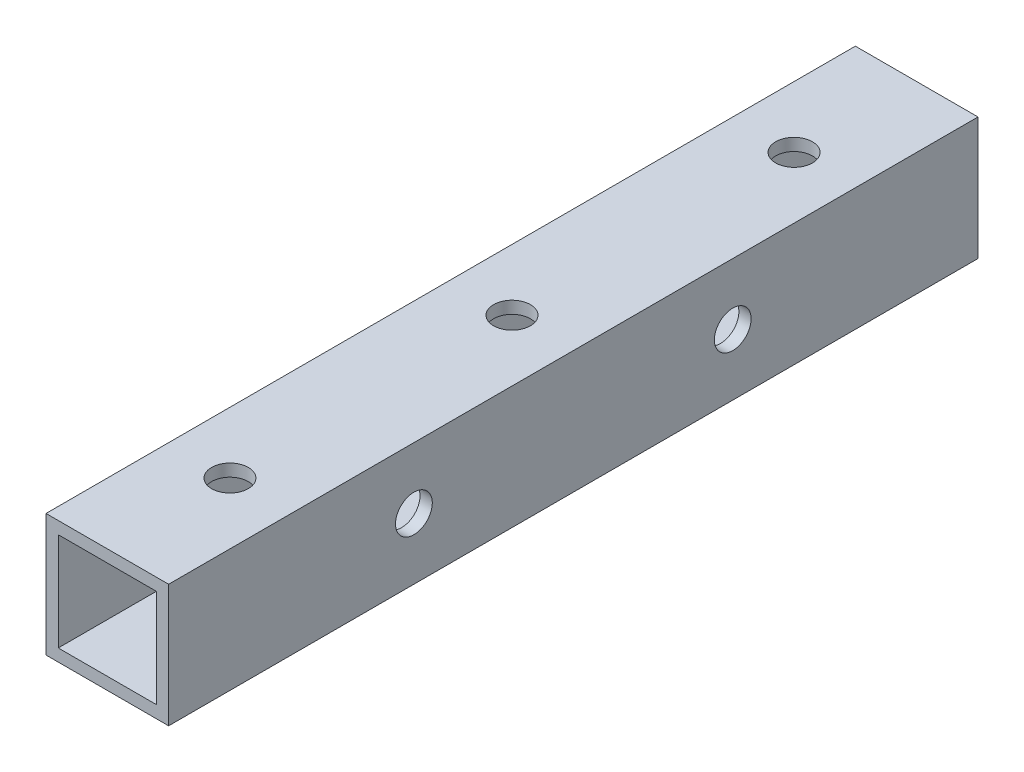
ISO-10303-21;
HEADER;
FILE_DESCRIPTION(('STEP AP214'),'2;1');
FILE_NAME('part.step','',(''),(''),'','','');
FILE_SCHEMA(('AUTOMOTIVE_DESIGN { 1 0 10303 214 1 1 1 1 }'));
ENDSEC;
DATA;
#1=APPLICATION_CONTEXT('core data for automotive mechanical design processes');
#2=APPLICATION_PROTOCOL_DEFINITION('international standard','automotive_design',2000,#1);
#3=PRODUCT_CONTEXT('',#1,'mechanical');
#4=PRODUCT('Part','Part','',(#3));
#5=PRODUCT_RELATED_PRODUCT_CATEGORY('part','',(#4));
#6=PRODUCT_DEFINITION_FORMATION('','',#4);
#7=PRODUCT_DEFINITION_CONTEXT('part definition',#1,'design');
#8=PRODUCT_DEFINITION('design','',#6,#7);
#9=PRODUCT_DEFINITION_SHAPE('','',#8);
#10=(LENGTH_UNIT() NAMED_UNIT(*) SI_UNIT(.MILLI.,.METRE.));
#11=(NAMED_UNIT(*) PLANE_ANGLE_UNIT() SI_UNIT($,.RADIAN.));
#12=(NAMED_UNIT(*) SI_UNIT($,.STERADIAN.) SOLID_ANGLE_UNIT());
#13=UNCERTAINTY_MEASURE_WITH_UNIT(LENGTH_MEASURE(1.E-05),#10,'distance_accuracy_value','');
#14=(GEOMETRIC_REPRESENTATION_CONTEXT(3) GLOBAL_UNCERTAINTY_ASSIGNED_CONTEXT((#13)) GLOBAL_UNIT_ASSIGNED_CONTEXT((#10,
#11,#12)) REPRESENTATION_CONTEXT('',''));
#15=CARTESIAN_POINT('',(0.,0.,0.));
#16=DIRECTION('',(0.,0.,1.));
#17=DIRECTION('',(1.,0.,0.));
#18=AXIS2_PLACEMENT_3D('',#15,#16,#17);
#19=CARTESIAN_POINT('',(0.,0.,66.));
#20=DIRECTION('',(0.,0.,1.));
#21=DIRECTION('',(1.,0.,0.));
#22=AXIS2_PLACEMENT_3D('',#19,#20,#21);
#23=PLANE('',#22);
#24=DIRECTION('',(0.,1.,0.));
#25=VECTOR('',#24,1.);
#26=CARTESIAN_POINT('',(-58.1295848709085,118.346996024389,66.));
#27=LINE('',#26,#25);
#28=CARTESIAN_POINT('',(-58.1295848709085,108.346996024389,66.));
#29=VERTEX_POINT('',#28);
#30=CARTESIAN_POINT('',(-58.1295848709085,118.346996024389,66.));
#31=VERTEX_POINT('',#30);
#32=EDGE_CURVE('E168',#29,#31,#27,.T.);
#33=ORIENTED_EDGE('',*,*,#32,.T.);
#34=DIRECTION('',(-1.,0.,0.));
#35=VECTOR('',#34,1.);
#36=CARTESIAN_POINT('',(-58.1295848709085,118.346996024389,66.));
#37=LINE('',#36,#35);
#38=CARTESIAN_POINT('',(-68.1295848709085,118.346996024389,66.));
#39=VERTEX_POINT('',#38);
#40=EDGE_CURVE('E171',#31,#39,#37,.T.);
#41=ORIENTED_EDGE('',*,*,#40,.T.);
#42=DIRECTION('',(0.,-1.,0.));
#43=VECTOR('',#42,1.);
#44=CARTESIAN_POINT('',(-68.1295848709085,118.346996024389,66.));
#45=LINE('',#44,#43);
#46=CARTESIAN_POINT('',(-68.1295848709085,108.346996024389,66.));
#47=VERTEX_POINT('',#46);
#48=EDGE_CURVE('E174',#39,#47,#45,.T.);
#49=ORIENTED_EDGE('',*,*,#48,.T.);
#50=DIRECTION('',(1.,0.,0.));
#51=VECTOR('',#50,1.);
#52=CARTESIAN_POINT('',(-58.1295848709085,108.346996024389,66.));
#53=LINE('',#52,#51);
#54=EDGE_CURVE('E176',#47,#29,#53,.T.);
#55=ORIENTED_EDGE('',*,*,#54,.T.);
#56=EDGE_LOOP('',(#33,#41,#49,#55));
#57=FACE_BOUND('',#56,.T.);
#58=DIRECTION('',(-1.,0.,0.));
#59=VECTOR('',#58,1.);
#60=CARTESIAN_POINT('',(0.,117.346996024389,66.));
#61=LINE('',#60,#59);
#62=CARTESIAN_POINT('',(-59.1295848709085,117.346996024389,66.));
#63=VERTEX_POINT('',#62);
#64=CARTESIAN_POINT('',(-67.1295848709085,117.346996024389,66.));
#65=VERTEX_POINT('',#64);
#66=EDGE_CURVE('E138',#63,#65,#61,.T.);
#67=ORIENTED_EDGE('',*,*,#66,.F.);
#68=DIRECTION('',(0.,1.,0.));
#69=VECTOR('',#68,1.);
#70=CARTESIAN_POINT('',(-59.1295848709085,0.,66.));
#71=LINE('',#70,#69);
#72=CARTESIAN_POINT('',(-59.1295848709085,109.346996024389,66.));
#73=VERTEX_POINT('',#72);
#74=EDGE_CURVE('E130',#73,#63,#71,.T.);
#75=ORIENTED_EDGE('',*,*,#74,.F.);
#76=DIRECTION('',(1.,0.,0.));
#77=VECTOR('',#76,1.);
#78=CARTESIAN_POINT('',(0.,109.346996024389,66.));
#79=LINE('',#78,#77);
#80=CARTESIAN_POINT('',(-67.1295848709085,109.346996024389,66.));
#81=VERTEX_POINT('',#80);
#82=EDGE_CURVE('E152',#81,#73,#79,.T.);
#83=ORIENTED_EDGE('',*,*,#82,.F.);
#84=DIRECTION('',(0.,-1.,0.));
#85=VECTOR('',#84,1.);
#86=CARTESIAN_POINT('',(-67.1295848709085,0.,66.));
#87=LINE('',#86,#85);
#88=EDGE_CURVE('E150',#65,#81,#87,.T.);
#89=ORIENTED_EDGE('',*,*,#88,.F.);
#90=EDGE_LOOP('',(#67,#75,#83,#89));
#91=FACE_BOUND('',#90,.T.);
#92=ADVANCED_FACE('F63',(#57,#91),#23,.T.);
#93=CARTESIAN_POINT('',(0.,0.,0.));
#94=DIRECTION('',(0.,0.,1.));
#95=DIRECTION('',(1.,0.,0.));
#96=AXIS2_PLACEMENT_3D('',#93,#94,#95);
#97=PLANE('',#96);
#98=DIRECTION('',(0.,1.,0.));
#99=VECTOR('',#98,1.);
#100=CARTESIAN_POINT('',(-58.1295848709085,118.346996024389,0.));
#101=LINE('',#100,#99);
#102=CARTESIAN_POINT('',(-58.1295848709085,108.346996024389,0.));
#103=VERTEX_POINT('',#102);
#104=CARTESIAN_POINT('',(-58.1295848709085,118.346996024389,0.));
#105=VERTEX_POINT('',#104);
#106=EDGE_CURVE('E146',#103,#105,#101,.T.);
#107=ORIENTED_EDGE('',*,*,#106,.F.);
#108=DIRECTION('',(1.,0.,0.));
#109=VECTOR('',#108,1.);
#110=CARTESIAN_POINT('',(-58.1295848709085,108.346996024389,0.));
#111=LINE('',#110,#109);
#112=CARTESIAN_POINT('',(-68.1295848709085,108.346996024389,0.));
#113=VERTEX_POINT('',#112);
#114=EDGE_CURVE('E172',#113,#103,#111,.T.);
#115=ORIENTED_EDGE('',*,*,#114,.F.);
#116=DIRECTION('',(0.,-1.,0.));
#117=VECTOR('',#116,1.);
#118=CARTESIAN_POINT('',(-68.1295848709085,118.346996024389,0.));
#119=LINE('',#118,#117);
#120=CARTESIAN_POINT('',(-68.1295848709085,118.346996024389,0.));
#121=VERTEX_POINT('',#120);
#122=EDGE_CURVE('E183',#121,#113,#119,.T.);
#123=ORIENTED_EDGE('',*,*,#122,.F.);
#124=DIRECTION('',(-1.,0.,0.));
#125=VECTOR('',#124,1.);
#126=CARTESIAN_POINT('',(-58.1295848709085,118.346996024389,0.));
#127=LINE('',#126,#125);
#128=EDGE_CURVE('E181',#105,#121,#127,.T.);
#129=ORIENTED_EDGE('',*,*,#128,.F.);
#130=EDGE_LOOP('',(#107,#115,#123,#129));
#131=FACE_BOUND('',#130,.T.);
#132=DIRECTION('',(0.,1.,0.));
#133=VECTOR('',#132,1.);
#134=CARTESIAN_POINT('',(-59.1295848709085,0.,0.));
#135=LINE('',#134,#133);
#136=CARTESIAN_POINT('',(-59.1295848709085,109.346996024389,0.));
#137=VERTEX_POINT('',#136);
#138=CARTESIAN_POINT('',(-59.1295848709085,117.346996024389,0.));
#139=VERTEX_POINT('',#138);
#140=EDGE_CURVE('E88',#137,#139,#135,.T.);
#141=ORIENTED_EDGE('',*,*,#140,.T.);
#142=DIRECTION('',(-1.,0.,0.));
#143=VECTOR('',#142,1.);
#144=CARTESIAN_POINT('',(0.,117.346996024389,0.));
#145=LINE('',#144,#143);
#146=CARTESIAN_POINT('',(-67.1295848709085,117.346996024389,0.));
#147=VERTEX_POINT('',#146);
#148=EDGE_CURVE('E145',#139,#147,#145,.T.);
#149=ORIENTED_EDGE('',*,*,#148,.T.);
#150=DIRECTION('',(0.,-1.,0.));
#151=VECTOR('',#150,1.);
#152=CARTESIAN_POINT('',(-67.1295848709085,0.,0.));
#153=LINE('',#152,#151);
#154=CARTESIAN_POINT('',(-67.1295848709085,109.346996024389,0.));
#155=VERTEX_POINT('',#154);
#156=EDGE_CURVE('E160',#147,#155,#153,.T.);
#157=ORIENTED_EDGE('',*,*,#156,.T.);
#158=DIRECTION('',(1.,0.,0.));
#159=VECTOR('',#158,1.);
#160=CARTESIAN_POINT('',(0.,109.346996024389,0.));
#161=LINE('',#160,#159);
#162=EDGE_CURVE('E139',#155,#137,#161,.T.);
#163=ORIENTED_EDGE('',*,*,#162,.T.);
#164=EDGE_LOOP('',(#141,#149,#157,#163));
#165=FACE_BOUND('',#164,.T.);
#166=ADVANCED_FACE('F258',(#131,#165),#97,.F.);
#167=CARTESIAN_POINT('',(-58.1295848709085,118.346996024389,66.));
#168=DIRECTION('',(-1.,0.,0.));
#169=DIRECTION('',(0.,0.,1.));
#170=AXIS2_PLACEMENT_3D('',#167,#168,#169);
#171=PLANE('',#170);
#172=CARTESIAN_POINT('',(-58.1295848709085,113.346996024389,20.));
#173=DIRECTION('',(1.,0.,0.));
#174=DIRECTION('',(0.,0.,-1.));
#175=AXIS2_PLACEMENT_3D('',#172,#173,#174);
#176=CIRCLE('',#175,1.5);
#177=CARTESIAN_POINT('',(-58.1295848709085,113.346996024389,18.5));
#178=VERTEX_POINT('',#177);
#179=EDGE_CURVE('E226',#178,#178,#176,.T.);
#180=ORIENTED_EDGE('',*,*,#179,.F.);
#181=EDGE_LOOP('',(#180));
#182=FACE_BOUND('',#181,.T.);
#183=CARTESIAN_POINT('',(-58.1295848709085,113.346996024389,46.));
#184=DIRECTION('',(1.,0.,0.));
#185=DIRECTION('',(0.,0.,1.));
#186=AXIS2_PLACEMENT_3D('',#183,#184,#185);
#187=CIRCLE('',#186,1.5);
#188=CARTESIAN_POINT('',(-58.1295848709085,113.346996024389,47.5));
#189=VERTEX_POINT('',#188);
#190=EDGE_CURVE('E229',#189,#189,#187,.T.);
#191=ORIENTED_EDGE('',*,*,#190,.F.);
#192=EDGE_LOOP('',(#191));
#193=FACE_BOUND('',#192,.T.);
#194=ORIENTED_EDGE('',*,*,#106,.T.);
#195=DIRECTION('',(0.,0.,-1.));
#196=VECTOR('',#195,1.);
#197=CARTESIAN_POINT('',(-58.1295848709085,118.346996024389,66.));
#198=LINE('',#197,#196);
#199=EDGE_CURVE('E12',#31,#105,#198,.T.);
#200=ORIENTED_EDGE('',*,*,#199,.F.);
#201=ORIENTED_EDGE('',*,*,#32,.F.);
#202=DIRECTION('',(0.,0.,-1.));
#203=VECTOR('',#202,1.);
#204=CARTESIAN_POINT('',(-58.1295848709085,108.346996024389,66.));
#205=LINE('',#204,#203);
#206=EDGE_CURVE('E178',#29,#103,#205,.T.);
#207=ORIENTED_EDGE('',*,*,#206,.T.);
#208=EDGE_LOOP('',(#194,#200,#201,#207));
#209=FACE_BOUND('',#208,.T.);
#210=ADVANCED_FACE('F65',(#182,#193,#209),#171,.F.);
#211=CARTESIAN_POINT('',(-58.1295848709085,118.346996024389,66.));
#212=DIRECTION('',(0.,-1.,0.));
#213=DIRECTION('',(0.,0.,-1.));
#214=AXIS2_PLACEMENT_3D('',#211,#212,#213);
#215=PLANE('',#214);
#216=CARTESIAN_POINT('',(-63.1295848709085,118.346996024389,10.));
#217=DIRECTION('',(0.,-1.,0.));
#218=DIRECTION('',(0.,0.,-1.));
#219=AXIS2_PLACEMENT_3D('',#216,#217,#218);
#220=CIRCLE('',#219,1.5);
#221=CARTESIAN_POINT('',(-63.1295848709085,118.346996024389,8.5));
#222=VERTEX_POINT('',#221);
#223=EDGE_CURVE('E204',#222,#222,#220,.T.);
#224=ORIENTED_EDGE('',*,*,#223,.T.);
#225=EDGE_LOOP('',(#224));
#226=FACE_BOUND('',#225,.T.);
#227=CARTESIAN_POINT('',(-63.1295848709085,118.346996024389,56.));
#228=DIRECTION('',(0.,-1.,0.));
#229=DIRECTION('',(0.,0.,1.));
#230=AXIS2_PLACEMENT_3D('',#227,#228,#229);
#231=CIRCLE('',#230,1.5);
#232=CARTESIAN_POINT('',(-63.1295848709085,118.346996024389,57.5));
#233=VERTEX_POINT('',#232);
#234=EDGE_CURVE('E347',#233,#233,#231,.T.);
#235=ORIENTED_EDGE('',*,*,#234,.T.);
#236=EDGE_LOOP('',(#235));
#237=FACE_BOUND('',#236,.T.);
#238=CARTESIAN_POINT('',(-63.1295848709085,118.346996024389,33.));
#239=DIRECTION('',(0.,-1.,0.));
#240=DIRECTION('',(0.,0.,-1.));
#241=AXIS2_PLACEMENT_3D('',#238,#239,#240);
#242=CIRCLE('',#241,1.5);
#243=CARTESIAN_POINT('',(-63.1295848709085,118.346996024389,31.5));
#244=VERTEX_POINT('',#243);
#245=EDGE_CURVE('E217',#244,#244,#242,.T.);
#246=ORIENTED_EDGE('',*,*,#245,.T.);
#247=EDGE_LOOP('',(#246));
#248=FACE_BOUND('',#247,.T.);
#249=ORIENTED_EDGE('',*,*,#128,.T.);
#250=DIRECTION('',(0.,0.,-1.));
#251=VECTOR('',#250,1.);
#252=CARTESIAN_POINT('',(-68.1295848709085,118.346996024389,66.));
#253=LINE('',#252,#251);
#254=EDGE_CURVE('E72',#39,#121,#253,.T.);
#255=ORIENTED_EDGE('',*,*,#254,.F.);
#256=ORIENTED_EDGE('',*,*,#40,.F.);
#257=ORIENTED_EDGE('',*,*,#199,.T.);
#258=EDGE_LOOP('',(#249,#255,#256,#257));
#259=FACE_BOUND('',#258,.T.);
#260=ADVANCED_FACE('F257',(#226,#237,#248,#259),#215,.F.);
#261=CARTESIAN_POINT('',(-68.1295848709085,118.346996024389,66.));
#262=DIRECTION('',(1.,0.,0.));
#263=DIRECTION('',(0.,0.,-1.));
#264=AXIS2_PLACEMENT_3D('',#261,#262,#263);
#265=PLANE('',#264);
#266=CARTESIAN_POINT('',(-68.1295848709085,113.346996024389,20.));
#267=DIRECTION('',(1.,0.,0.));
#268=DIRECTION('',(0.,0.,-1.));
#269=AXIS2_PLACEMENT_3D('',#266,#267,#268);
#270=CIRCLE('',#269,1.5);
#271=CARTESIAN_POINT('',(-68.1295848709085,113.346996024389,18.5));
#272=VERTEX_POINT('',#271);
#273=EDGE_CURVE('E197',#272,#272,#270,.T.);
#274=ORIENTED_EDGE('',*,*,#273,.T.);
#275=EDGE_LOOP('',(#274));
#276=FACE_BOUND('',#275,.T.);
#277=CARTESIAN_POINT('',(-68.1295848709085,113.346996024389,46.));
#278=DIRECTION('',(1.,0.,0.));
#279=DIRECTION('',(0.,0.,1.));
#280=AXIS2_PLACEMENT_3D('',#277,#278,#279);
#281=CIRCLE('',#280,1.5);
#282=CARTESIAN_POINT('',(-68.1295848709085,113.346996024389,47.5));
#283=VERTEX_POINT('',#282);
#284=EDGE_CURVE('E223',#283,#283,#281,.T.);
#285=ORIENTED_EDGE('',*,*,#284,.T.);
#286=EDGE_LOOP('',(#285));
#287=FACE_BOUND('',#286,.T.);
#288=ORIENTED_EDGE('',*,*,#122,.T.);
#289=DIRECTION('',(0.,0.,-1.));
#290=VECTOR('',#289,1.);
#291=CARTESIAN_POINT('',(-68.1295848709085,108.346996024389,66.));
#292=LINE('',#291,#290);
#293=EDGE_CURVE('E188',#47,#113,#292,.T.);
#294=ORIENTED_EDGE('',*,*,#293,.F.);
#295=ORIENTED_EDGE('',*,*,#48,.F.);
#296=ORIENTED_EDGE('',*,*,#254,.T.);
#297=EDGE_LOOP('',(#288,#294,#295,#296));
#298=FACE_BOUND('',#297,.T.);
#299=ADVANCED_FACE('F276',(#276,#287,#298),#265,.F.);
#300=CARTESIAN_POINT('',(-58.1295848709085,108.346996024389,66.));
#301=DIRECTION('',(0.,1.,0.));
#302=DIRECTION('',(0.,0.,1.));
#303=AXIS2_PLACEMENT_3D('',#300,#301,#302);
#304=PLANE('',#303);
#305=CARTESIAN_POINT('',(-63.1295848709085,108.346996024389,10.));
#306=DIRECTION('',(0.,-1.,0.));
#307=DIRECTION('',(0.,0.,-1.));
#308=AXIS2_PLACEMENT_3D('',#305,#306,#307);
#309=CIRCLE('',#308,1.5);
#310=CARTESIAN_POINT('',(-63.1295848709085,108.346996024389,8.5));
#311=VERTEX_POINT('',#310);
#312=EDGE_CURVE('E339',#311,#311,#309,.T.);
#313=ORIENTED_EDGE('',*,*,#312,.F.);
#314=EDGE_LOOP('',(#313));
#315=FACE_BOUND('',#314,.T.);
#316=CARTESIAN_POINT('',(-63.1295848709085,108.346996024389,56.));
#317=DIRECTION('',(0.,-1.,0.));
#318=DIRECTION('',(0.,0.,1.));
#319=AXIS2_PLACEMENT_3D('',#316,#317,#318);
#320=CIRCLE('',#319,1.5);
#321=CARTESIAN_POINT('',(-63.1295848709085,108.346996024389,57.5));
#322=VERTEX_POINT('',#321);
#323=EDGE_CURVE('E342',#322,#322,#320,.T.);
#324=ORIENTED_EDGE('',*,*,#323,.F.);
#325=EDGE_LOOP('',(#324));
#326=FACE_BOUND('',#325,.T.);
#327=CARTESIAN_POINT('',(-63.1295848709085,108.346996024389,33.));
#328=DIRECTION('',(0.,-1.,0.));
#329=DIRECTION('',(0.,0.,-1.));
#330=AXIS2_PLACEMENT_3D('',#327,#328,#329);
#331=CIRCLE('',#330,1.5);
#332=CARTESIAN_POINT('',(-63.1295848709085,108.346996024389,31.5));
#333=VERTEX_POINT('',#332);
#334=EDGE_CURVE('E349',#333,#333,#331,.T.);
#335=ORIENTED_EDGE('',*,*,#334,.F.);
#336=EDGE_LOOP('',(#335));
#337=FACE_BOUND('',#336,.T.);
#338=ORIENTED_EDGE('',*,*,#114,.T.);
#339=ORIENTED_EDGE('',*,*,#206,.F.);
#340=ORIENTED_EDGE('',*,*,#54,.F.);
#341=ORIENTED_EDGE('',*,*,#293,.T.);
#342=EDGE_LOOP('',(#338,#339,#340,#341));
#343=FACE_BOUND('',#342,.T.);
#344=ADVANCED_FACE('F243',(#315,#326,#337,#343),#304,.F.);
#345=CARTESIAN_POINT('',(-59.1295848709085,0.,66.));
#346=DIRECTION('',(-1.,0.,0.));
#347=DIRECTION('',(0.,0.,1.));
#348=AXIS2_PLACEMENT_3D('',#345,#346,#347);
#349=PLANE('',#348);
#350=CARTESIAN_POINT('',(-59.1295848709085,113.346996024389,20.));
#351=DIRECTION('',(-1.,0.,0.));
#352=DIRECTION('',(0.,0.,1.));
#353=AXIS2_PLACEMENT_3D('',#350,#351,#352);
#354=CIRCLE('',#353,1.5);
#355=CARTESIAN_POINT('',(-59.1295848709085,113.346996024389,21.5));
#356=VERTEX_POINT('',#355);
#357=EDGE_CURVE('E158',#356,#356,#354,.T.);
#358=ORIENTED_EDGE('',*,*,#357,.F.);
#359=EDGE_LOOP('',(#358));
#360=FACE_BOUND('',#359,.T.);
#361=CARTESIAN_POINT('',(-59.1295848709085,113.346996024389,46.));
#362=DIRECTION('',(-1.,0.,0.));
#363=DIRECTION('',(0.,0.,1.));
#364=AXIS2_PLACEMENT_3D('',#361,#362,#363);
#365=CIRCLE('',#364,1.5);
#366=CARTESIAN_POINT('',(-59.1295848709085,113.346996024389,47.5));
#367=VERTEX_POINT('',#366);
#368=EDGE_CURVE('E196',#367,#367,#365,.T.);
#369=ORIENTED_EDGE('',*,*,#368,.F.);
#370=EDGE_LOOP('',(#369));
#371=FACE_BOUND('',#370,.T.);
#372=ORIENTED_EDGE('',*,*,#140,.F.);
#373=DIRECTION('',(0.,0.,-1.));
#374=VECTOR('',#373,1.);
#375=CARTESIAN_POINT('',(-59.1295848709085,109.346996024389,66.));
#376=LINE('',#375,#374);
#377=EDGE_CURVE('E134',#73,#137,#376,.T.);
#378=ORIENTED_EDGE('',*,*,#377,.F.);
#379=ORIENTED_EDGE('',*,*,#74,.T.);
#380=DIRECTION('',(0.,0.,-1.));
#381=VECTOR('',#380,1.);
#382=CARTESIAN_POINT('',(-59.1295848709085,117.346996024389,66.));
#383=LINE('',#382,#381);
#384=EDGE_CURVE('E133',#63,#139,#383,.T.);
#385=ORIENTED_EDGE('',*,*,#384,.T.);
#386=EDGE_LOOP('',(#372,#378,#379,#385));
#387=FACE_BOUND('',#386,.T.);
#388=ADVANCED_FACE('F132',(#360,#371,#387),#349,.T.);
#389=CARTESIAN_POINT('',(0.,117.346996024389,66.));
#390=DIRECTION('',(0.,-1.,0.));
#391=DIRECTION('',(0.,0.,-1.));
#392=AXIS2_PLACEMENT_3D('',#389,#390,#391);
#393=PLANE('',#392);
#394=CARTESIAN_POINT('',(-63.1295848709085,117.346996024389,10.));
#395=DIRECTION('',(0.,-1.,0.));
#396=DIRECTION('',(0.,0.,-1.));
#397=AXIS2_PLACEMENT_3D('',#394,#395,#396);
#398=CIRCLE('',#397,1.5);
#399=CARTESIAN_POINT('',(-63.1295848709085,117.346996024389,8.5));
#400=VERTEX_POINT('',#399);
#401=EDGE_CURVE('E220',#400,#400,#398,.T.);
#402=ORIENTED_EDGE('',*,*,#401,.F.);
#403=EDGE_LOOP('',(#402));
#404=FACE_BOUND('',#403,.T.);
#405=CARTESIAN_POINT('',(-63.1295848709085,117.346996024389,56.));
#406=DIRECTION('',(0.,-1.,0.));
#407=DIRECTION('',(0.,0.,-1.));
#408=AXIS2_PLACEMENT_3D('',#405,#406,#407);
#409=CIRCLE('',#408,1.5);
#410=CARTESIAN_POINT('',(-63.1295848709085,117.346996024389,54.5));
#411=VERTEX_POINT('',#410);
#412=EDGE_CURVE('E207',#411,#411,#409,.T.);
#413=ORIENTED_EDGE('',*,*,#412,.F.);
#414=EDGE_LOOP('',(#413));
#415=FACE_BOUND('',#414,.T.);
#416=CARTESIAN_POINT('',(-63.1295848709085,117.346996024389,33.));
#417=DIRECTION('',(0.,-1.,0.));
#418=DIRECTION('',(0.,0.,-1.));
#419=AXIS2_PLACEMENT_3D('',#416,#417,#418);
#420=CIRCLE('',#419,1.5);
#421=CARTESIAN_POINT('',(-63.1295848709085,117.346996024389,31.5));
#422=VERTEX_POINT('',#421);
#423=EDGE_CURVE('E203',#422,#422,#420,.T.);
#424=ORIENTED_EDGE('',*,*,#423,.F.);
#425=EDGE_LOOP('',(#424));
#426=FACE_BOUND('',#425,.T.);
#427=ORIENTED_EDGE('',*,*,#148,.F.);
#428=ORIENTED_EDGE('',*,*,#384,.F.);
#429=ORIENTED_EDGE('',*,*,#66,.T.);
#430=DIRECTION('',(0.,0.,-1.));
#431=VECTOR('',#430,1.);
#432=CARTESIAN_POINT('',(-67.1295848709085,117.346996024389,66.));
#433=LINE('',#432,#431);
#434=EDGE_CURVE('E147',#65,#147,#433,.T.);
#435=ORIENTED_EDGE('',*,*,#434,.T.);
#436=EDGE_LOOP('',(#427,#428,#429,#435));
#437=FACE_BOUND('',#436,.T.);
#438=ADVANCED_FACE('F142',(#404,#415,#426,#437),#393,.T.);
#439=CARTESIAN_POINT('',(-67.1295848709085,0.,66.));
#440=DIRECTION('',(1.,0.,0.));
#441=DIRECTION('',(0.,0.,-1.));
#442=AXIS2_PLACEMENT_3D('',#439,#440,#441);
#443=PLANE('',#442);
#444=CARTESIAN_POINT('',(-67.1295848709085,113.346996024389,20.));
#445=DIRECTION('',(1.,0.,0.));
#446=DIRECTION('',(0.,0.,-1.));
#447=AXIS2_PLACEMENT_3D('',#444,#445,#446);
#448=CIRCLE('',#447,1.5);
#449=CARTESIAN_POINT('',(-67.1295848709085,113.346996024389,18.5));
#450=VERTEX_POINT('',#449);
#451=EDGE_CURVE('E198',#450,#450,#448,.T.);
#452=ORIENTED_EDGE('',*,*,#451,.F.);
#453=EDGE_LOOP('',(#452));
#454=FACE_BOUND('',#453,.T.);
#455=CARTESIAN_POINT('',(-67.1295848709085,113.346996024389,46.));
#456=DIRECTION('',(1.,0.,0.));
#457=DIRECTION('',(0.,0.,-1.));
#458=AXIS2_PLACEMENT_3D('',#455,#456,#457);
#459=CIRCLE('',#458,1.5);
#460=CARTESIAN_POINT('',(-67.1295848709085,113.346996024389,44.5));
#461=VERTEX_POINT('',#460);
#462=EDGE_CURVE('E193',#461,#461,#459,.T.);
#463=ORIENTED_EDGE('',*,*,#462,.F.);
#464=EDGE_LOOP('',(#463));
#465=FACE_BOUND('',#464,.T.);
#466=ORIENTED_EDGE('',*,*,#156,.F.);
#467=ORIENTED_EDGE('',*,*,#434,.F.);
#468=ORIENTED_EDGE('',*,*,#88,.T.);
#469=DIRECTION('',(0.,0.,-1.));
#470=VECTOR('',#469,1.);
#471=CARTESIAN_POINT('',(-67.1295848709085,109.346996024389,66.));
#472=LINE('',#471,#470);
#473=EDGE_CURVE('E80',#81,#155,#472,.T.);
#474=ORIENTED_EDGE('',*,*,#473,.T.);
#475=EDGE_LOOP('',(#466,#467,#468,#474));
#476=FACE_BOUND('',#475,.T.);
#477=ADVANCED_FACE('F297',(#454,#465,#476),#443,.T.);
#478=CARTESIAN_POINT('',(0.,109.346996024389,66.));
#479=DIRECTION('',(0.,1.,0.));
#480=DIRECTION('',(0.,0.,1.));
#481=AXIS2_PLACEMENT_3D('',#478,#479,#480);
#482=PLANE('',#481);
#483=CARTESIAN_POINT('',(-63.1295848709085,109.346996024389,10.));
#484=DIRECTION('',(0.,1.,0.));
#485=DIRECTION('',(0.,0.,1.));
#486=AXIS2_PLACEMENT_3D('',#483,#484,#485);
#487=CIRCLE('',#486,1.5);
#488=CARTESIAN_POINT('',(-63.1295848709085,109.346996024389,11.5));
#489=VERTEX_POINT('',#488);
#490=EDGE_CURVE('E67',#489,#489,#487,.T.);
#491=ORIENTED_EDGE('',*,*,#490,.F.);
#492=EDGE_LOOP('',(#491));
#493=FACE_BOUND('',#492,.T.);
#494=CARTESIAN_POINT('',(-63.1295848709085,109.346996024389,56.));
#495=DIRECTION('',(0.,1.,0.));
#496=DIRECTION('',(0.,0.,1.));
#497=AXIS2_PLACEMENT_3D('',#494,#495,#496);
#498=CIRCLE('',#497,1.5);
#499=CARTESIAN_POINT('',(-63.1295848709085,109.346996024389,57.5));
#500=VERTEX_POINT('',#499);
#501=EDGE_CURVE('E205',#500,#500,#498,.T.);
#502=ORIENTED_EDGE('',*,*,#501,.F.);
#503=EDGE_LOOP('',(#502));
#504=FACE_BOUND('',#503,.T.);
#505=CARTESIAN_POINT('',(-63.1295848709085,109.346996024389,33.));
#506=DIRECTION('',(0.,1.,0.));
#507=DIRECTION('',(0.,0.,1.));
#508=AXIS2_PLACEMENT_3D('',#505,#506,#507);
#509=CIRCLE('',#508,1.5);
#510=CARTESIAN_POINT('',(-63.1295848709085,109.346996024389,34.5));
#511=VERTEX_POINT('',#510);
#512=EDGE_CURVE('E201',#511,#511,#509,.T.);
#513=ORIENTED_EDGE('',*,*,#512,.F.);
#514=EDGE_LOOP('',(#513));
#515=FACE_BOUND('',#514,.T.);
#516=ORIENTED_EDGE('',*,*,#162,.F.);
#517=ORIENTED_EDGE('',*,*,#473,.F.);
#518=ORIENTED_EDGE('',*,*,#82,.T.);
#519=ORIENTED_EDGE('',*,*,#377,.T.);
#520=EDGE_LOOP('',(#516,#517,#518,#519));
#521=FACE_BOUND('',#520,.T.);
#522=ADVANCED_FACE('F301',(#493,#504,#515,#521),#482,.T.);
#523=CARTESIAN_POINT('',(-68.1295848709085,113.346996024389,46.));
#524=DIRECTION('',(1.,0.,0.));
#525=DIRECTION('',(0.,0.,-1.));
#526=AXIS2_PLACEMENT_3D('',#523,#524,#525);
#527=CYLINDRICAL_SURFACE('',#526,1.5);
#528=ORIENTED_EDGE('',*,*,#462,.T.);
#529=EDGE_LOOP('',(#528));
#530=FACE_BOUND('',#529,.T.);
#531=ORIENTED_EDGE('',*,*,#284,.F.);
#532=EDGE_LOOP('',(#531));
#533=FACE_BOUND('',#532,.T.);
#534=ADVANCED_FACE('F252',(#530,#533),#527,.F.);
#535=CARTESIAN_POINT('',(-68.1295848709085,113.346996024389,20.));
#536=DIRECTION('',(1.,0.,0.));
#537=DIRECTION('',(0.,0.,-1.));
#538=AXIS2_PLACEMENT_3D('',#535,#536,#537);
#539=CYLINDRICAL_SURFACE('',#538,1.5);
#540=ORIENTED_EDGE('',*,*,#451,.T.);
#541=EDGE_LOOP('',(#540));
#542=FACE_BOUND('',#541,.T.);
#543=ORIENTED_EDGE('',*,*,#273,.F.);
#544=EDGE_LOOP('',(#543));
#545=FACE_BOUND('',#544,.T.);
#546=ADVANCED_FACE('F250',(#542,#545),#539,.F.);
#547=ORIENTED_EDGE('',*,*,#368,.T.);
#548=EDGE_LOOP('',(#547));
#549=FACE_BOUND('',#548,.T.);
#550=ORIENTED_EDGE('',*,*,#190,.T.);
#551=EDGE_LOOP('',(#550));
#552=FACE_BOUND('',#551,.T.);
#553=ADVANCED_FACE('F247',(#549,#552),#527,.F.);
#554=ORIENTED_EDGE('',*,*,#357,.T.);
#555=EDGE_LOOP('',(#554));
#556=FACE_BOUND('',#555,.T.);
#557=ORIENTED_EDGE('',*,*,#179,.T.);
#558=EDGE_LOOP('',(#557));
#559=FACE_BOUND('',#558,.T.);
#560=ADVANCED_FACE('F238',(#556,#559),#539,.F.);
#561=CARTESIAN_POINT('',(-63.1295848709085,118.346996024389,33.));
#562=DIRECTION('',(0.,-1.,0.));
#563=DIRECTION('',(0.,0.,-1.));
#564=AXIS2_PLACEMENT_3D('',#561,#562,#563);
#565=CYLINDRICAL_SURFACE('',#564,1.5);
#566=ORIENTED_EDGE('',*,*,#512,.T.);
#567=EDGE_LOOP('',(#566));
#568=FACE_BOUND('',#567,.T.);
#569=ORIENTED_EDGE('',*,*,#334,.T.);
#570=EDGE_LOOP('',(#569));
#571=FACE_BOUND('',#570,.T.);
#572=ADVANCED_FACE('F311',(#568,#571),#565,.F.);
#573=CARTESIAN_POINT('',(-63.1295848709085,118.346996024389,56.));
#574=DIRECTION('',(0.,-1.,0.));
#575=DIRECTION('',(0.,0.,-1.));
#576=AXIS2_PLACEMENT_3D('',#573,#574,#575);
#577=CYLINDRICAL_SURFACE('',#576,1.5);
#578=ORIENTED_EDGE('',*,*,#501,.T.);
#579=EDGE_LOOP('',(#578));
#580=FACE_BOUND('',#579,.T.);
#581=ORIENTED_EDGE('',*,*,#323,.T.);
#582=EDGE_LOOP('',(#581));
#583=FACE_BOUND('',#582,.T.);
#584=ADVANCED_FACE('F314',(#580,#583),#577,.F.);
#585=CARTESIAN_POINT('',(-63.1295848709085,118.346996024389,10.));
#586=DIRECTION('',(0.,-1.,0.));
#587=DIRECTION('',(0.,0.,-1.));
#588=AXIS2_PLACEMENT_3D('',#585,#586,#587);
#589=CYLINDRICAL_SURFACE('',#588,1.5);
#590=ORIENTED_EDGE('',*,*,#490,.T.);
#591=EDGE_LOOP('',(#590));
#592=FACE_BOUND('',#591,.T.);
#593=ORIENTED_EDGE('',*,*,#312,.T.);
#594=EDGE_LOOP('',(#593));
#595=FACE_BOUND('',#594,.T.);
#596=ADVANCED_FACE('F319',(#592,#595),#589,.F.);
#597=ORIENTED_EDGE('',*,*,#423,.T.);
#598=EDGE_LOOP('',(#597));
#599=FACE_BOUND('',#598,.T.);
#600=ORIENTED_EDGE('',*,*,#245,.F.);
#601=EDGE_LOOP('',(#600));
#602=FACE_BOUND('',#601,.T.);
#603=ADVANCED_FACE('F316',(#599,#602),#565,.F.);
#604=ORIENTED_EDGE('',*,*,#412,.T.);
#605=EDGE_LOOP('',(#604));
#606=FACE_BOUND('',#605,.T.);
#607=ORIENTED_EDGE('',*,*,#234,.F.);
#608=EDGE_LOOP('',(#607));
#609=FACE_BOUND('',#608,.T.);
#610=ADVANCED_FACE('F320',(#606,#609),#577,.F.);
#611=ORIENTED_EDGE('',*,*,#401,.T.);
#612=EDGE_LOOP('',(#611));
#613=FACE_BOUND('',#612,.T.);
#614=ORIENTED_EDGE('',*,*,#223,.F.);
#615=EDGE_LOOP('',(#614));
#616=FACE_BOUND('',#615,.T.);
#617=ADVANCED_FACE('F323',(#613,#616),#589,.F.);
#618=CLOSED_SHELL('',(#92,#166,#210,#260,#299,#344,#388,#438,#477,#522,#534,#546,#553,#560,#572,
#584,#596,#603,#610,#617));
#619=MANIFOLD_SOLID_BREP('B2',#618);
#620=ADVANCED_BREP_SHAPE_REPRESENTATION('',(#18,#619),#14);
#621=SHAPE_DEFINITION_REPRESENTATION(#9,#620);
ENDSEC;
END-ISO-10303-21;
